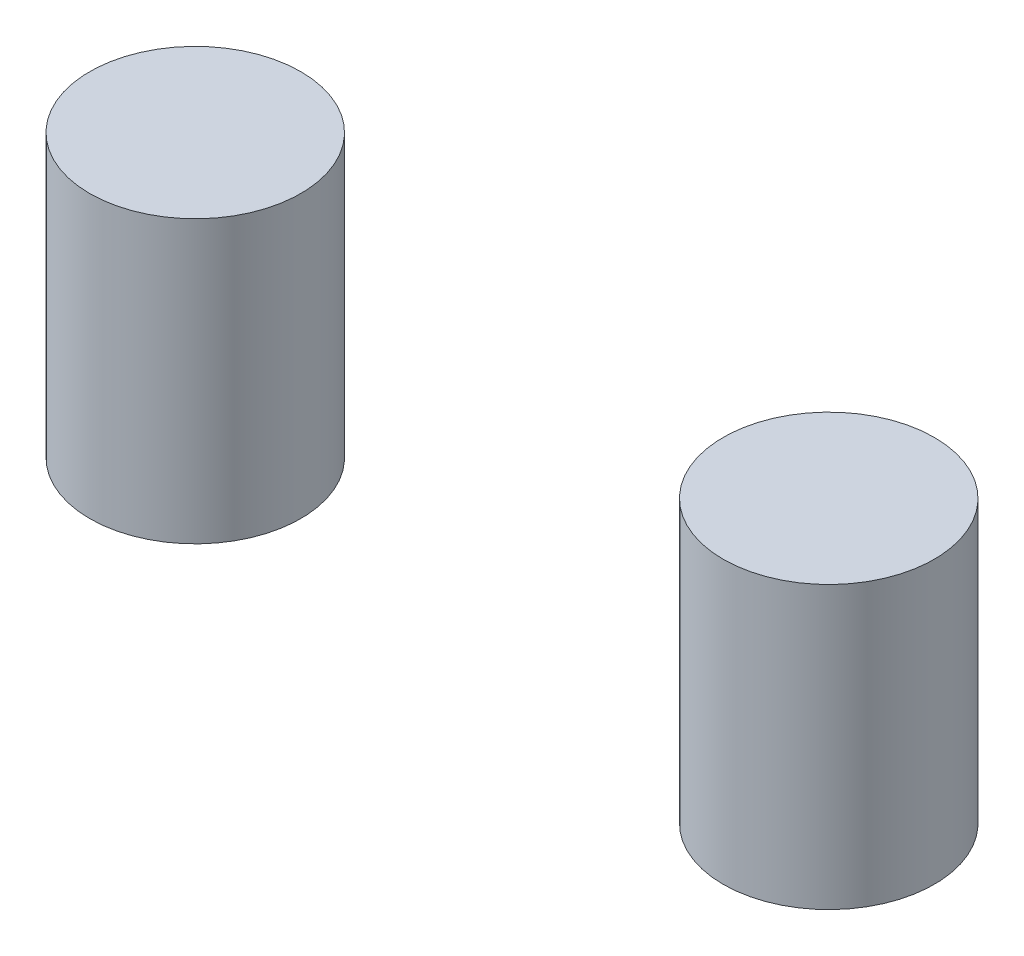
ISO-10303-21;
HEADER;
FILE_DESCRIPTION(('STEP AP214'),'2;1');
FILE_NAME('part.step','',(''),(''),'','','');
FILE_SCHEMA(('AUTOMOTIVE_DESIGN { 1 0 10303 214 1 1 1 1 }'));
ENDSEC;
DATA;
#1=APPLICATION_CONTEXT('core data for automotive mechanical design processes');
#2=APPLICATION_PROTOCOL_DEFINITION('international standard','automotive_design',2000,#1);
#3=PRODUCT_CONTEXT('',#1,'mechanical');
#4=PRODUCT('Part','Part','',(#3));
#5=PRODUCT_RELATED_PRODUCT_CATEGORY('part','',(#4));
#6=PRODUCT_DEFINITION_FORMATION('','',#4);
#7=PRODUCT_DEFINITION_CONTEXT('part definition',#1,'design');
#8=PRODUCT_DEFINITION('design','',#6,#7);
#9=PRODUCT_DEFINITION_SHAPE('','',#8);
#10=(LENGTH_UNIT() NAMED_UNIT(*) SI_UNIT(.MILLI.,.METRE.));
#11=(NAMED_UNIT(*) PLANE_ANGLE_UNIT() SI_UNIT($,.RADIAN.));
#12=(NAMED_UNIT(*) SI_UNIT($,.STERADIAN.) SOLID_ANGLE_UNIT());
#13=UNCERTAINTY_MEASURE_WITH_UNIT(LENGTH_MEASURE(1.E-05),#10,'distance_accuracy_value','');
#14=(GEOMETRIC_REPRESENTATION_CONTEXT(3) GLOBAL_UNCERTAINTY_ASSIGNED_CONTEXT((#13)) GLOBAL_UNIT_ASSIGNED_CONTEXT((#10,
#11,#12)) REPRESENTATION_CONTEXT('',''));
#15=CARTESIAN_POINT('',(0.,0.,0.));
#16=DIRECTION('',(0.,0.,1.));
#17=DIRECTION('',(1.,0.,0.));
#18=AXIS2_PLACEMENT_3D('',#15,#16,#17);
#19=CARTESIAN_POINT('',(90.,80.,0.));
#20=DIRECTION('',(0.,-1.,0.));
#21=DIRECTION('',(0.,0.,-1.));
#22=AXIS2_PLACEMENT_3D('',#19,#20,#21);
#23=CYLINDRICAL_SURFACE('',#22,30.);
#24=CARTESIAN_POINT('',(90.,80.,0.));
#25=DIRECTION('',(0.,1.,0.));
#26=DIRECTION('',(0.,0.,1.));
#27=AXIS2_PLACEMENT_3D('',#24,#25,#26);
#28=CIRCLE('',#27,30.);
#29=CARTESIAN_POINT('',(90.,80.,30.));
#30=VERTEX_POINT('',#29);
#31=EDGE_CURVE('E11',#30,#30,#28,.T.);
#32=ORIENTED_EDGE('',*,*,#31,.F.);
#33=EDGE_LOOP('',(#32));
#34=FACE_BOUND('',#33,.T.);
#35=CARTESIAN_POINT('',(90.,0.,0.));
#36=DIRECTION('',(0.,1.,0.));
#37=DIRECTION('',(0.,0.,1.));
#38=AXIS2_PLACEMENT_3D('',#35,#36,#37);
#39=CIRCLE('',#38,30.);
#40=CARTESIAN_POINT('',(90.,0.,30.));
#41=VERTEX_POINT('',#40);
#42=EDGE_CURVE('E44',#41,#41,#39,.T.);
#43=ORIENTED_EDGE('',*,*,#42,.T.);
#44=EDGE_LOOP('',(#43));
#45=FACE_BOUND('',#44,.T.);
#46=ADVANCED_FACE('F41',(#34,#45),#23,.T.);
#47=CARTESIAN_POINT('',(90.,80.,0.));
#48=DIRECTION('',(0.,1.,0.));
#49=DIRECTION('',(0.,0.,1.));
#50=AXIS2_PLACEMENT_3D('',#47,#48,#49);
#51=PLANE('',#50);
#52=ORIENTED_EDGE('',*,*,#31,.T.);
#53=EDGE_LOOP('',(#52));
#54=FACE_BOUND('',#53,.T.);
#55=ADVANCED_FACE('F56',(#54),#51,.T.);
#56=CARTESIAN_POINT('',(90.,0.,0.));
#57=DIRECTION('',(0.,1.,0.));
#58=DIRECTION('',(0.,0.,1.));
#59=AXIS2_PLACEMENT_3D('',#56,#57,#58);
#60=PLANE('',#59);
#61=ORIENTED_EDGE('',*,*,#42,.F.);
#62=EDGE_LOOP('',(#61));
#63=FACE_BOUND('',#62,.T.);
#64=ADVANCED_FACE('F54',(#63),#60,.F.);
#65=CLOSED_SHELL('',(#46,#55,#64));
#66=MANIFOLD_SOLID_BREP('B2',#65);
#67=CARTESIAN_POINT('',(-90.,80.,0.));
#68=DIRECTION('',(0.,-1.,0.));
#69=DIRECTION('',(0.,0.,-1.));
#70=AXIS2_PLACEMENT_3D('',#67,#68,#69);
#71=CYLINDRICAL_SURFACE('',#70,30.);
#72=CARTESIAN_POINT('',(-90.,80.,0.));
#73=DIRECTION('',(0.,1.,0.));
#74=DIRECTION('',(0.,0.,1.));
#75=AXIS2_PLACEMENT_3D('',#72,#73,#74);
#76=CIRCLE('',#75,30.);
#77=CARTESIAN_POINT('',(-90.,80.,30.));
#78=VERTEX_POINT('',#77);
#79=EDGE_CURVE('E40',#78,#78,#76,.T.);
#80=ORIENTED_EDGE('',*,*,#79,.F.);
#81=EDGE_LOOP('',(#80));
#82=FACE_BOUND('',#81,.T.);
#83=CARTESIAN_POINT('',(-90.,0.,0.));
#84=DIRECTION('',(0.,1.,0.));
#85=DIRECTION('',(0.,0.,1.));
#86=AXIS2_PLACEMENT_3D('',#83,#84,#85);
#87=CIRCLE('',#86,30.);
#88=CARTESIAN_POINT('',(-90.,0.,30.));
#89=VERTEX_POINT('',#88);
#90=EDGE_CURVE('E85',#89,#89,#87,.T.);
#91=ORIENTED_EDGE('',*,*,#90,.T.);
#92=EDGE_LOOP('',(#91));
#93=FACE_BOUND('',#92,.T.);
#94=ADVANCED_FACE('F82',(#82,#93),#71,.T.);
#95=CARTESIAN_POINT('',(-90.,80.,0.));
#96=DIRECTION('',(0.,1.,0.));
#97=DIRECTION('',(0.,0.,1.));
#98=AXIS2_PLACEMENT_3D('',#95,#96,#97);
#99=PLANE('',#98);
#100=ORIENTED_EDGE('',*,*,#79,.T.);
#101=EDGE_LOOP('',(#100));
#102=FACE_BOUND('',#101,.T.);
#103=ADVANCED_FACE('F97',(#102),#99,.T.);
#104=CARTESIAN_POINT('',(-90.,0.,0.));
#105=DIRECTION('',(0.,1.,0.));
#106=DIRECTION('',(0.,0.,1.));
#107=AXIS2_PLACEMENT_3D('',#104,#105,#106);
#108=PLANE('',#107);
#109=ORIENTED_EDGE('',*,*,#90,.F.);
#110=EDGE_LOOP('',(#109));
#111=FACE_BOUND('',#110,.T.);
#112=ADVANCED_FACE('F95',(#111),#108,.F.);
#113=CLOSED_SHELL('',(#94,#103,#112));
#114=MANIFOLD_SOLID_BREP('B6',#113);
#115=ADVANCED_BREP_SHAPE_REPRESENTATION('',(#18,#66,#114),#14);
#116=SHAPE_DEFINITION_REPRESENTATION(#9,#115);
ENDSEC;
END-ISO-10303-21;
